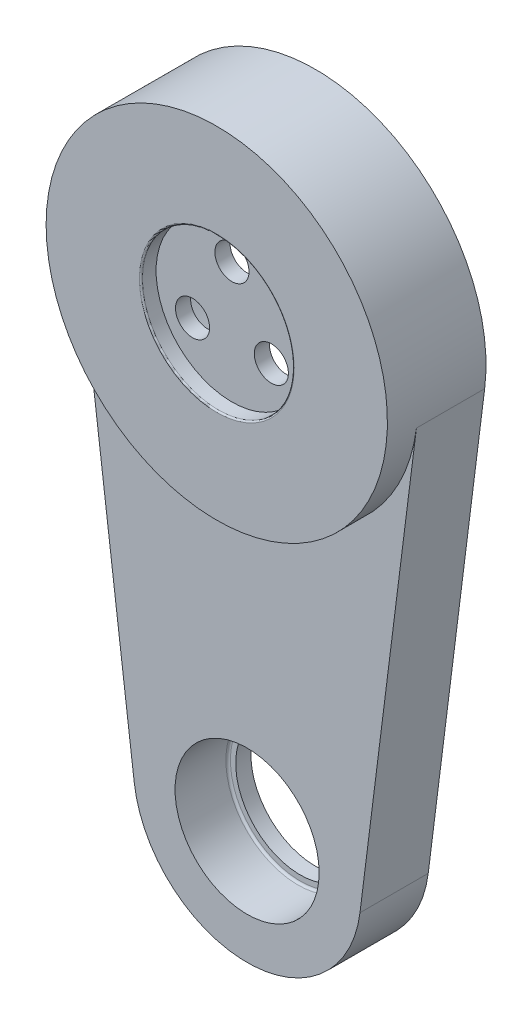
ISO-10303-21;
HEADER;
FILE_DESCRIPTION(('STEP AP214'),'2;1');
FILE_NAME('part.step','',(''),(''),'','','');
FILE_SCHEMA(('AUTOMOTIVE_DESIGN { 1 0 10303 214 1 1 1 1 }'));
ENDSEC;
DATA;
#1=APPLICATION_CONTEXT('core data for automotive mechanical design processes');
#2=APPLICATION_PROTOCOL_DEFINITION('international standard','automotive_design',2000,#1);
#3=PRODUCT_CONTEXT('',#1,'mechanical');
#4=PRODUCT('Part','Part','',(#3));
#5=PRODUCT_RELATED_PRODUCT_CATEGORY('part','',(#4));
#6=PRODUCT_DEFINITION_FORMATION('','',#4);
#7=PRODUCT_DEFINITION_CONTEXT('part definition',#1,'design');
#8=PRODUCT_DEFINITION('design','',#6,#7);
#9=PRODUCT_DEFINITION_SHAPE('','',#8);
#10=(LENGTH_UNIT() NAMED_UNIT(*) SI_UNIT(.MILLI.,.METRE.));
#11=(NAMED_UNIT(*) PLANE_ANGLE_UNIT() SI_UNIT($,.RADIAN.));
#12=(NAMED_UNIT(*) SI_UNIT($,.STERADIAN.) SOLID_ANGLE_UNIT());
#13=UNCERTAINTY_MEASURE_WITH_UNIT(LENGTH_MEASURE(1.E-05),#10,'distance_accuracy_value','');
#14=(GEOMETRIC_REPRESENTATION_CONTEXT(3) GLOBAL_UNCERTAINTY_ASSIGNED_CONTEXT((#13)) GLOBAL_UNIT_ASSIGNED_CONTEXT((#10,
#11,#12)) REPRESENTATION_CONTEXT('',''));
#15=CARTESIAN_POINT('',(0.,0.,0.));
#16=DIRECTION('',(0.,0.,1.));
#17=DIRECTION('',(1.,0.,0.));
#18=AXIS2_PLACEMENT_3D('',#15,#16,#17);
#19=CARTESIAN_POINT('',(0.,0.,-5.));
#20=DIRECTION('',(0.,0.,-1.));
#21=DIRECTION('',(-1.,0.,0.));
#22=AXIS2_PLACEMENT_3D('',#19,#20,#21);
#23=PLANE('',#22);
#24=CARTESIAN_POINT('',(0.,6.,-5.));
#25=DIRECTION('',(0.,0.,-1.));
#26=DIRECTION('',(-1.,0.,0.));
#27=AXIS2_PLACEMENT_3D('',#24,#25,#26);
#28=CIRCLE('',#27,3.99999999999999);
#29=CARTESIAN_POINT('',(-3.99999999999999,6.,-5.));
#30=VERTEX_POINT('',#29);
#31=EDGE_CURVE('E134',#30,#30,#28,.T.);
#32=ORIENTED_EDGE('',*,*,#31,.F.);
#33=EDGE_LOOP('',(#32));
#34=FACE_BOUND('',#33,.T.);
#35=CARTESIAN_POINT('',(-5.19615242270662,-3.00000000000003,-5.));
#36=DIRECTION('',(0.,0.,-1.));
#37=DIRECTION('',(-1.,0.,0.));
#38=AXIS2_PLACEMENT_3D('',#35,#36,#37);
#39=CIRCLE('',#38,3.99999999999999);
#40=CARTESIAN_POINT('',(-9.19615242270661,-3.00000000000003,-5.));
#41=VERTEX_POINT('',#40);
#42=EDGE_CURVE('E124',#41,#41,#39,.T.);
#43=ORIENTED_EDGE('',*,*,#42,.F.);
#44=EDGE_LOOP('',(#43));
#45=FACE_BOUND('',#44,.T.);
#46=CARTESIAN_POINT('',(5.19615242270666,-2.99999999999995,-5.));
#47=DIRECTION('',(0.,0.,-1.));
#48=DIRECTION('',(-1.,0.,0.));
#49=AXIS2_PLACEMENT_3D('',#46,#47,#48);
#50=CIRCLE('',#49,3.99999999999999);
#51=CARTESIAN_POINT('',(1.19615242270667,-2.99999999999995,-5.));
#52=VERTEX_POINT('',#51);
#53=EDGE_CURVE('E114',#52,#52,#50,.T.);
#54=ORIENTED_EDGE('',*,*,#53,.F.);
#55=EDGE_LOOP('',(#54));
#56=FACE_BOUND('',#55,.T.);
#57=CARTESIAN_POINT('',(0.,0.,-5.));
#58=DIRECTION('',(0.,0.,-1.));
#59=DIRECTION('',(-1.,0.,0.));
#60=AXIS2_PLACEMENT_3D('',#57,#58,#59);
#61=CIRCLE('',#60,17.5);
#62=CARTESIAN_POINT('',(-17.5,0.,-5.));
#63=VERTEX_POINT('',#62);
#64=EDGE_CURVE('E161',#63,#63,#61,.F.);
#65=ORIENTED_EDGE('',*,*,#64,.F.);
#66=EDGE_LOOP('',(#65));
#67=FACE_BOUND('',#66,.T.);
#68=ADVANCED_FACE('F35',(#34,#45,#56,#67),#23,.T.);
#69=CARTESIAN_POINT('',(0.,0.,-2.));
#70=DIRECTION('',(0.,0.,1.));
#71=DIRECTION('',(1.,0.,0.));
#72=AXIS2_PLACEMENT_3D('',#69,#70,#71);
#73=CYLINDRICAL_SURFACE('',#72,22.5);
#74=CARTESIAN_POINT('',(0.,0.,0.));
#75=DIRECTION('',(0.,0.,-1.));
#76=DIRECTION('',(-1.,0.,0.));
#77=AXIS2_PLACEMENT_3D('',#74,#75,#76);
#78=CIRCLE('',#77,22.5);
#79=CARTESIAN_POINT('',(-22.5,0.,0.));
#80=VERTEX_POINT('',#79);
#81=EDGE_CURVE('E152',#80,#80,#78,.T.);
#82=ORIENTED_EDGE('',*,*,#81,.T.);
#83=EDGE_LOOP('',(#82));
#84=FACE_BOUND('',#83,.T.);
#85=CARTESIAN_POINT('',(0.,0.,-13.));
#86=DIRECTION('',(0.,0.,-1.));
#87=DIRECTION('',(-1.,0.,0.));
#88=AXIS2_PLACEMENT_3D('',#85,#86,#87);
#89=CIRCLE('',#88,22.5);
#90=CARTESIAN_POINT('',(-22.3235266871075,-2.81250000000001,-13.));
#91=VERTEX_POINT('',#90);
#92=CARTESIAN_POINT('',(22.3235266871075,-2.81250000000001,-13.));
#93=VERTEX_POINT('',#92);
#94=EDGE_CURVE('E147',#91,#93,#89,.T.);
#95=ORIENTED_EDGE('',*,*,#94,.F.);
#96=DIRECTION('',(0.,0.,-1.));
#97=VECTOR('',#96,1.);
#98=CARTESIAN_POINT('',(-22.3235266871075,-2.81250000000001,-4.));
#99=LINE('',#98,#97);
#100=CARTESIAN_POINT('',(-22.3235266871075,-2.81250000000001,-4.));
#101=VERTEX_POINT('',#100);
#102=EDGE_CURVE('E107',#101,#91,#99,.T.);
#103=ORIENTED_EDGE('',*,*,#102,.F.);
#104=CARTESIAN_POINT('',(0.,0.,-4.));
#105=DIRECTION('',(0.,0.,1.));
#106=DIRECTION('',(-1.,0.,0.));
#107=AXIS2_PLACEMENT_3D('',#104,#105,#106);
#108=CIRCLE('',#107,22.5);
#109=CARTESIAN_POINT('',(22.3235266871075,-2.81250000000001,-4.));
#110=VERTEX_POINT('',#109);
#111=EDGE_CURVE('E59',#101,#110,#108,.T.);
#112=ORIENTED_EDGE('',*,*,#111,.T.);
#113=DIRECTION('',(0.,0.,-1.));
#114=VECTOR('',#113,1.);
#115=CARTESIAN_POINT('',(22.3235266871075,-2.81250000000001,-4.));
#116=LINE('',#115,#114);
#117=EDGE_CURVE('E83',#110,#93,#116,.T.);
#118=ORIENTED_EDGE('',*,*,#117,.T.);
#119=EDGE_LOOP('',(#95,#103,#112,#118));
#120=FACE_BOUND('',#119,.T.);
#121=ADVANCED_FACE('F191',(#84,#120),#73,.T.);
#122=CARTESIAN_POINT('',(0.,0.,0.));
#123=DIRECTION('',(0.,0.,-1.));
#124=DIRECTION('',(-1.,0.,0.));
#125=AXIS2_PLACEMENT_3D('',#122,#123,#124);
#126=PLANE('',#125);
#127=CARTESIAN_POINT('',(0.,0.,0.));
#128=DIRECTION('',(0.,0.,-1.));
#129=DIRECTION('',(-1.,0.,0.));
#130=AXIS2_PLACEMENT_3D('',#127,#128,#129);
#131=CIRCLE('',#130,10.2);
#132=CARTESIAN_POINT('',(-10.2,0.,0.));
#133=VERTEX_POINT('',#132);
#134=EDGE_CURVE('E158',#133,#133,#131,.T.);
#135=ORIENTED_EDGE('',*,*,#134,.T.);
#136=EDGE_LOOP('',(#135));
#137=FACE_BOUND('',#136,.T.);
#138=ORIENTED_EDGE('',*,*,#81,.F.);
#139=EDGE_LOOP('',(#138));
#140=FACE_BOUND('',#139,.T.);
#141=ADVANCED_FACE('F197',(#137,#140),#126,.F.);
#142=CARTESIAN_POINT('',(0.,0.,-2.));
#143=DIRECTION('',(0.,0.,1.));
#144=DIRECTION('',(1.,0.,0.));
#145=AXIS2_PLACEMENT_3D('',#142,#143,#144);
#146=CYLINDRICAL_SURFACE('',#145,10.);
#147=CARTESIAN_POINT('',(0.,0.,-0.2));
#148=DIRECTION('',(0.,0.,-1.));
#149=DIRECTION('',(-1.,0.,0.));
#150=AXIS2_PLACEMENT_3D('',#147,#148,#149);
#151=CIRCLE('',#150,10.);
#152=CARTESIAN_POINT('',(-10.,0.,-0.2));
#153=VERTEX_POINT('',#152);
#154=EDGE_CURVE('E155',#153,#153,#151,.F.);
#155=ORIENTED_EDGE('',*,*,#154,.T.);
#156=EDGE_LOOP('',(#155));
#157=FACE_BOUND('',#156,.T.);
#158=CARTESIAN_POINT('',(0.,0.,-2.));
#159=DIRECTION('',(0.,0.,1.));
#160=DIRECTION('',(1.,0.,0.));
#161=AXIS2_PLACEMENT_3D('',#158,#159,#160);
#162=CIRCLE('',#161,10.);
#163=CARTESIAN_POINT('',(10.,0.,-2.));
#164=VERTEX_POINT('',#163);
#165=EDGE_CURVE('E149',#164,#164,#162,.T.);
#166=ORIENTED_EDGE('',*,*,#165,.F.);
#167=EDGE_LOOP('',(#166));
#168=FACE_BOUND('',#167,.T.);
#169=ADVANCED_FACE('F219',(#157,#168),#146,.F.);
#170=CARTESIAN_POINT('',(0.,0.,-0.2));
#171=DIRECTION('',(0.,0.,-1.));
#172=DIRECTION('',(-1.,0.,0.));
#173=AXIS2_PLACEMENT_3D('',#170,#171,#172);
#174=TOROIDAL_SURFACE('',#173,10.2,0.2);
#175=ORIENTED_EDGE('',*,*,#134,.F.);
#176=EDGE_LOOP('',(#175));
#177=FACE_BOUND('',#176,.T.);
#178=ORIENTED_EDGE('',*,*,#154,.F.);
#179=EDGE_LOOP('',(#178));
#180=FACE_BOUND('',#179,.T.);
#181=ADVANCED_FACE('F217',(#177,#180),#174,.T.);
#182=CARTESIAN_POINT('',(0.,0.,-2.));
#183=DIRECTION('',(0.,0.,-1.));
#184=DIRECTION('',(-1.,0.,0.));
#185=AXIS2_PLACEMENT_3D('',#182,#183,#184);
#186=PLANE('',#185);
#187=CARTESIAN_POINT('',(5.19615242270666,-2.99999999999995,-2.));
#188=DIRECTION('',(0.,0.,-1.));
#189=DIRECTION('',(-1.,0.,0.));
#190=AXIS2_PLACEMENT_3D('',#187,#188,#189);
#191=CIRCLE('',#190,2.25);
#192=CARTESIAN_POINT('',(2.94615242270666,-2.99999999999995,-2.));
#193=VERTEX_POINT('',#192);
#194=EDGE_CURVE('E123',#193,#193,#191,.T.);
#195=ORIENTED_EDGE('',*,*,#194,.T.);
#196=EDGE_LOOP('',(#195));
#197=FACE_BOUND('',#196,.T.);
#198=CARTESIAN_POINT('',(-5.19615242270662,-3.00000000000003,-2.));
#199=DIRECTION('',(0.,0.,-1.));
#200=DIRECTION('',(-1.,0.,0.));
#201=AXIS2_PLACEMENT_3D('',#198,#199,#200);
#202=CIRCLE('',#201,2.25);
#203=CARTESIAN_POINT('',(-7.44615242270662,-3.00000000000003,-2.));
#204=VERTEX_POINT('',#203);
#205=EDGE_CURVE('E133',#204,#204,#202,.T.);
#206=ORIENTED_EDGE('',*,*,#205,.T.);
#207=EDGE_LOOP('',(#206));
#208=FACE_BOUND('',#207,.T.);
#209=CARTESIAN_POINT('',(0.,6.,-2.));
#210=DIRECTION('',(0.,0.,-1.));
#211=DIRECTION('',(-1.,0.,0.));
#212=AXIS2_PLACEMENT_3D('',#209,#210,#211);
#213=CIRCLE('',#212,2.25);
#214=CARTESIAN_POINT('',(-2.25,6.,-2.));
#215=VERTEX_POINT('',#214);
#216=EDGE_CURVE('E143',#215,#215,#213,.T.);
#217=ORIENTED_EDGE('',*,*,#216,.T.);
#218=EDGE_LOOP('',(#217));
#219=FACE_BOUND('',#218,.T.);
#220=ORIENTED_EDGE('',*,*,#165,.T.);
#221=EDGE_LOOP('',(#220));
#222=FACE_BOUND('',#221,.T.);
#223=ADVANCED_FACE('F213',(#197,#208,#219,#222),#186,.F.);
#224=CARTESIAN_POINT('',(0.,0.,-13.));
#225=DIRECTION('',(0.,0.,-1.));
#226=DIRECTION('',(-1.,0.,0.));
#227=AXIS2_PLACEMENT_3D('',#224,#225,#226);
#228=PLANE('',#227);
#229=CARTESIAN_POINT('',(0.,-60.,-13.));
#230=DIRECTION('',(0.,0.,1.));
#231=DIRECTION('',(1.,0.,0.));
#232=AXIS2_PLACEMENT_3D('',#229,#230,#231);
#233=CIRCLE('',#232,8.50000000000001);
#234=CARTESIAN_POINT('',(8.5,-60.,-13.));
#235=VERTEX_POINT('',#234);
#236=EDGE_CURVE('E516',#235,#235,#233,.T.);
#237=ORIENTED_EDGE('',*,*,#236,.T.);
#238=EDGE_LOOP('',(#237));
#239=FACE_BOUND('',#238,.T.);
#240=CARTESIAN_POINT('',(0.,0.,-13.));
#241=DIRECTION('',(0.,0.,-1.));
#242=DIRECTION('',(-1.,0.,0.));
#243=AXIS2_PLACEMENT_3D('',#240,#241,#242);
#244=CIRCLE('',#243,18.5);
#245=CARTESIAN_POINT('',(-18.5,0.,-13.));
#246=VERTEX_POINT('',#245);
#247=EDGE_CURVE('E144',#246,#246,#244,.T.);
#248=ORIENTED_EDGE('',*,*,#247,.F.);
#249=EDGE_LOOP('',(#248));
#250=FACE_BOUND('',#249,.T.);
#251=ORIENTED_EDGE('',*,*,#94,.T.);
#252=DIRECTION('',(-0.125,-0.992156741649222,0.));
#253=VECTOR('',#252,1.);
#254=CARTESIAN_POINT('',(22.3235266871075,-2.81250000000001,-13.));
#255=LINE('',#254,#253);
#256=CARTESIAN_POINT('',(14.8823511247383,-61.875,-13.));
#257=VERTEX_POINT('',#256);
#258=EDGE_CURVE('E102',#93,#257,#255,.T.);
#259=ORIENTED_EDGE('',*,*,#258,.T.);
#260=CARTESIAN_POINT('',(0.,-60.,-13.));
#261=DIRECTION('',(0.,0.,-1.));
#262=DIRECTION('',(-1.,0.,0.));
#263=AXIS2_PLACEMENT_3D('',#260,#261,#262);
#264=CIRCLE('',#263,15.);
#265=CARTESIAN_POINT('',(-14.8823511247383,-61.875,-13.));
#266=VERTEX_POINT('',#265);
#267=EDGE_CURVE('E89',#257,#266,#264,.T.);
#268=ORIENTED_EDGE('',*,*,#267,.T.);
#269=DIRECTION('',(-0.125,0.992156741649222,0.));
#270=VECTOR('',#269,1.);
#271=CARTESIAN_POINT('',(-22.3235266871075,-2.81250000000001,-13.));
#272=LINE('',#271,#270);
#273=EDGE_CURVE('E50',#266,#91,#272,.T.);
#274=ORIENTED_EDGE('',*,*,#273,.T.);
#275=EDGE_LOOP('',(#251,#259,#268,#274));
#276=FACE_BOUND('',#275,.T.);
#277=ADVANCED_FACE('F209',(#239,#250,#276),#228,.T.);
#278=CARTESIAN_POINT('',(0.,0.,-5.));
#279=DIRECTION('',(0.,0.,-1.));
#280=DIRECTION('',(-1.,0.,0.));
#281=AXIS2_PLACEMENT_3D('',#278,#279,#280);
#282=CYLINDRICAL_SURFACE('',#281,18.5);
#283=CARTESIAN_POINT('',(0.,0.,-6.3));
#284=DIRECTION('',(0.,0.,-1.));
#285=DIRECTION('',(-1.,0.,0.));
#286=AXIS2_PLACEMENT_3D('',#283,#284,#285);
#287=CIRCLE('',#286,18.5);
#288=CARTESIAN_POINT('',(-18.5,0.,-6.3));
#289=VERTEX_POINT('',#288);
#290=EDGE_CURVE('E173',#289,#289,#287,.F.);
#291=ORIENTED_EDGE('',*,*,#290,.T.);
#292=EDGE_LOOP('',(#291));
#293=FACE_BOUND('',#292,.T.);
#294=ORIENTED_EDGE('',*,*,#247,.T.);
#295=EDGE_LOOP('',(#294));
#296=FACE_BOUND('',#295,.T.);
#297=ADVANCED_FACE('F206',(#293,#296),#282,.F.);
#298=CARTESIAN_POINT('',(0.,6.,-5.));
#299=DIRECTION('',(0.,0.,-1.));
#300=DIRECTION('',(-1.,0.,0.));
#301=AXIS2_PLACEMENT_3D('',#298,#299,#300);
#302=CYLINDRICAL_SURFACE('',#301,2.25);
#303=CARTESIAN_POINT('',(0.,6.,-4.));
#304=DIRECTION('',(0.,0.,-1.));
#305=DIRECTION('',(-1.,0.,0.));
#306=AXIS2_PLACEMENT_3D('',#303,#304,#305);
#307=CIRCLE('',#306,2.25);
#308=CARTESIAN_POINT('',(-2.25,6.,-4.));
#309=VERTEX_POINT('',#308);
#310=EDGE_CURVE('E140',#309,#309,#307,.T.);
#311=ORIENTED_EDGE('',*,*,#310,.T.);
#312=EDGE_LOOP('',(#311));
#313=FACE_BOUND('',#312,.T.);
#314=ORIENTED_EDGE('',*,*,#216,.F.);
#315=EDGE_LOOP('',(#314));
#316=FACE_BOUND('',#315,.T.);
#317=ADVANCED_FACE('F204',(#313,#316),#302,.F.);
#318=CARTESIAN_POINT('',(2.25,6.,-4.));
#319=DIRECTION('',(0.,0.,1.));
#320=DIRECTION('',(1.,0.,0.));
#321=AXIS2_PLACEMENT_3D('',#318,#319,#320);
#322=PLANE('',#321);
#323=ORIENTED_EDGE('',*,*,#310,.F.);
#324=EDGE_LOOP('',(#323));
#325=FACE_BOUND('',#324,.T.);
#326=CARTESIAN_POINT('',(0.,6.,-4.));
#327=DIRECTION('',(0.,0.,-1.));
#328=DIRECTION('',(-1.,0.,0.));
#329=AXIS2_PLACEMENT_3D('',#326,#327,#328);
#330=CIRCLE('',#329,4.);
#331=CARTESIAN_POINT('',(-4.,6.,-4.));
#332=VERTEX_POINT('',#331);
#333=EDGE_CURVE('E137',#332,#332,#330,.T.);
#334=ORIENTED_EDGE('',*,*,#333,.T.);
#335=EDGE_LOOP('',(#334));
#336=FACE_BOUND('',#335,.T.);
#337=ADVANCED_FACE('F291',(#325,#336),#322,.F.);
#338=CARTESIAN_POINT('',(0.,6.,-5.));
#339=DIRECTION('',(0.,0.,-1.));
#340=DIRECTION('',(-1.,0.,0.));
#341=AXIS2_PLACEMENT_3D('',#338,#339,#340);
#342=CYLINDRICAL_SURFACE('',#341,4.);
#343=ORIENTED_EDGE('',*,*,#333,.F.);
#344=EDGE_LOOP('',(#343));
#345=FACE_BOUND('',#344,.T.);
#346=ORIENTED_EDGE('',*,*,#31,.T.);
#347=EDGE_LOOP('',(#346));
#348=FACE_BOUND('',#347,.T.);
#349=ADVANCED_FACE('F288',(#345,#348),#342,.F.);
#350=CARTESIAN_POINT('',(-5.19615242270662,-3.00000000000003,-5.));
#351=DIRECTION('',(0.,0.,-1.));
#352=DIRECTION('',(-1.,0.,0.));
#353=AXIS2_PLACEMENT_3D('',#350,#351,#352);
#354=CYLINDRICAL_SURFACE('',#353,2.25);
#355=CARTESIAN_POINT('',(-5.19615242270662,-3.00000000000003,-4.));
#356=DIRECTION('',(0.,0.,-1.));
#357=DIRECTION('',(-1.,0.,0.));
#358=AXIS2_PLACEMENT_3D('',#355,#356,#357);
#359=CIRCLE('',#358,2.25);
#360=CARTESIAN_POINT('',(-7.44615242270662,-3.00000000000003,-4.));
#361=VERTEX_POINT('',#360);
#362=EDGE_CURVE('E130',#361,#361,#359,.T.);
#363=ORIENTED_EDGE('',*,*,#362,.T.);
#364=EDGE_LOOP('',(#363));
#365=FACE_BOUND('',#364,.T.);
#366=ORIENTED_EDGE('',*,*,#205,.F.);
#367=EDGE_LOOP('',(#366));
#368=FACE_BOUND('',#367,.T.);
#369=ADVANCED_FACE('F284',(#365,#368),#354,.F.);
#370=CARTESIAN_POINT('',(-2.94615242270662,-3.00000000000003,-4.));
#371=DIRECTION('',(0.,0.,1.));
#372=DIRECTION('',(1.,0.,0.));
#373=AXIS2_PLACEMENT_3D('',#370,#371,#372);
#374=PLANE('',#373);
#375=ORIENTED_EDGE('',*,*,#362,.F.);
#376=EDGE_LOOP('',(#375));
#377=FACE_BOUND('',#376,.T.);
#378=CARTESIAN_POINT('',(-5.19615242270662,-3.00000000000003,-4.));
#379=DIRECTION('',(0.,0.,-1.));
#380=DIRECTION('',(-1.,0.,0.));
#381=AXIS2_PLACEMENT_3D('',#378,#379,#380);
#382=CIRCLE('',#381,4.);
#383=CARTESIAN_POINT('',(-9.19615242270662,-3.00000000000003,-4.));
#384=VERTEX_POINT('',#383);
#385=EDGE_CURVE('E127',#384,#384,#382,.T.);
#386=ORIENTED_EDGE('',*,*,#385,.T.);
#387=EDGE_LOOP('',(#386));
#388=FACE_BOUND('',#387,.T.);
#389=ADVANCED_FACE('F280',(#377,#388),#374,.F.);
#390=CARTESIAN_POINT('',(-5.19615242270662,-3.00000000000003,-5.));
#391=DIRECTION('',(0.,0.,-1.));
#392=DIRECTION('',(-1.,0.,0.));
#393=AXIS2_PLACEMENT_3D('',#390,#391,#392);
#394=CYLINDRICAL_SURFACE('',#393,4.);
#395=ORIENTED_EDGE('',*,*,#385,.F.);
#396=EDGE_LOOP('',(#395));
#397=FACE_BOUND('',#396,.T.);
#398=ORIENTED_EDGE('',*,*,#42,.T.);
#399=EDGE_LOOP('',(#398));
#400=FACE_BOUND('',#399,.T.);
#401=ADVANCED_FACE('F276',(#397,#400),#394,.F.);
#402=CARTESIAN_POINT('',(5.19615242270666,-2.99999999999995,-5.));
#403=DIRECTION('',(0.,0.,-1.));
#404=DIRECTION('',(-1.,0.,0.));
#405=AXIS2_PLACEMENT_3D('',#402,#403,#404);
#406=CYLINDRICAL_SURFACE('',#405,2.25);
#407=CARTESIAN_POINT('',(5.19615242270666,-2.99999999999995,-4.));
#408=DIRECTION('',(0.,0.,-1.));
#409=DIRECTION('',(-1.,0.,0.));
#410=AXIS2_PLACEMENT_3D('',#407,#408,#409);
#411=CIRCLE('',#410,2.25);
#412=CARTESIAN_POINT('',(2.94615242270666,-2.99999999999995,-4.));
#413=VERTEX_POINT('',#412);
#414=EDGE_CURVE('E120',#413,#413,#411,.T.);
#415=ORIENTED_EDGE('',*,*,#414,.T.);
#416=EDGE_LOOP('',(#415));
#417=FACE_BOUND('',#416,.T.);
#418=ORIENTED_EDGE('',*,*,#194,.F.);
#419=EDGE_LOOP('',(#418));
#420=FACE_BOUND('',#419,.T.);
#421=ADVANCED_FACE('F272',(#417,#420),#406,.F.);
#422=CARTESIAN_POINT('',(7.44615242270666,-2.99999999999995,-4.));
#423=DIRECTION('',(0.,0.,1.));
#424=DIRECTION('',(1.,0.,0.));
#425=AXIS2_PLACEMENT_3D('',#422,#423,#424);
#426=PLANE('',#425);
#427=ORIENTED_EDGE('',*,*,#414,.F.);
#428=EDGE_LOOP('',(#427));
#429=FACE_BOUND('',#428,.T.);
#430=CARTESIAN_POINT('',(5.19615242270666,-2.99999999999995,-4.));
#431=DIRECTION('',(0.,0.,-1.));
#432=DIRECTION('',(-1.,0.,0.));
#433=AXIS2_PLACEMENT_3D('',#430,#431,#432);
#434=CIRCLE('',#433,4.);
#435=CARTESIAN_POINT('',(1.19615242270666,-2.99999999999995,-4.));
#436=VERTEX_POINT('',#435);
#437=EDGE_CURVE('E117',#436,#436,#434,.T.);
#438=ORIENTED_EDGE('',*,*,#437,.T.);
#439=EDGE_LOOP('',(#438));
#440=FACE_BOUND('',#439,.T.);
#441=ADVANCED_FACE('F268',(#429,#440),#426,.F.);
#442=CARTESIAN_POINT('',(5.19615242270666,-2.99999999999995,-5.));
#443=DIRECTION('',(0.,0.,-1.));
#444=DIRECTION('',(-1.,0.,0.));
#445=AXIS2_PLACEMENT_3D('',#442,#443,#444);
#446=CYLINDRICAL_SURFACE('',#445,4.);
#447=ORIENTED_EDGE('',*,*,#437,.F.);
#448=EDGE_LOOP('',(#447));
#449=FACE_BOUND('',#448,.T.);
#450=ORIENTED_EDGE('',*,*,#53,.T.);
#451=EDGE_LOOP('',(#450));
#452=FACE_BOUND('',#451,.T.);
#453=ADVANCED_FACE('F248',(#449,#452),#446,.F.);
#454=CARTESIAN_POINT('',(0.,0.,-6.));
#455=DIRECTION('',(0.,0.,-1.));
#456=DIRECTION('',(-1.,0.,0.));
#457=AXIS2_PLACEMENT_3D('',#454,#455,#456);
#458=PLANE('',#457);
#459=CARTESIAN_POINT('',(0.,0.,-6.));
#460=DIRECTION('',(0.,0.,-1.));
#461=DIRECTION('',(-1.,0.,0.));
#462=AXIS2_PLACEMENT_3D('',#459,#460,#461);
#463=CIRCLE('',#462,18.2);
#464=CARTESIAN_POINT('',(-18.2,0.,-6.));
#465=VERTEX_POINT('',#464);
#466=EDGE_CURVE('E170',#465,#465,#463,.T.);
#467=ORIENTED_EDGE('',*,*,#466,.T.);
#468=EDGE_LOOP('',(#467));
#469=FACE_BOUND('',#468,.T.);
#470=CARTESIAN_POINT('',(0.,0.,-6.));
#471=DIRECTION('',(0.,0.,-1.));
#472=DIRECTION('',(-1.,0.,0.));
#473=AXIS2_PLACEMENT_3D('',#470,#471,#472);
#474=CIRCLE('',#473,17.5);
#475=CARTESIAN_POINT('',(-17.5,0.,-6.));
#476=VERTEX_POINT('',#475);
#477=EDGE_CURVE('E109',#476,#476,#474,.T.);
#478=ORIENTED_EDGE('',*,*,#477,.F.);
#479=EDGE_LOOP('',(#478));
#480=FACE_BOUND('',#479,.T.);
#481=ADVANCED_FACE('F244',(#469,#480),#458,.T.);
#482=CARTESIAN_POINT('',(0.,0.,-6.));
#483=DIRECTION('',(0.,0.,1.));
#484=DIRECTION('',(1.,0.,0.));
#485=AXIS2_PLACEMENT_3D('',#482,#483,#484);
#486=CYLINDRICAL_SURFACE('',#485,17.5);
#487=ORIENTED_EDGE('',*,*,#477,.T.);
#488=EDGE_LOOP('',(#487));
#489=FACE_BOUND('',#488,.T.);
#490=ORIENTED_EDGE('',*,*,#64,.T.);
#491=EDGE_LOOP('',(#490));
#492=FACE_BOUND('',#491,.T.);
#493=ADVANCED_FACE('F247',(#489,#492),#486,.F.);
#494=CARTESIAN_POINT('',(-22.3235266871075,-2.81250000000001,-4.));
#495=DIRECTION('',(-0.992156741649221,-0.125,0.));
#496=DIRECTION('',(0.125,-0.992156741649221,0.));
#497=AXIS2_PLACEMENT_3D('',#494,#495,#496);
#498=PLANE('',#497);
#499=ORIENTED_EDGE('',*,*,#273,.F.);
#500=DIRECTION('',(0.,0.,-1.));
#501=VECTOR('',#500,1.);
#502=CARTESIAN_POINT('',(-14.8823511247383,-61.875,-4.));
#503=LINE('',#502,#501);
#504=CARTESIAN_POINT('',(-14.8823511247383,-61.875,-4.));
#505=VERTEX_POINT('',#504);
#506=EDGE_CURVE('E77',#505,#266,#503,.T.);
#507=ORIENTED_EDGE('',*,*,#506,.F.);
#508=DIRECTION('',(-0.125,0.992156741649222,0.));
#509=VECTOR('',#508,1.);
#510=CARTESIAN_POINT('',(-22.3235266871075,-2.81250000000001,-4.));
#511=LINE('',#510,#509);
#512=EDGE_CURVE('E94',#505,#101,#511,.T.);
#513=ORIENTED_EDGE('',*,*,#512,.T.);
#514=ORIENTED_EDGE('',*,*,#102,.T.);
#515=EDGE_LOOP('',(#499,#507,#513,#514));
#516=FACE_BOUND('',#515,.T.);
#517=ADVANCED_FACE('F254',(#516),#498,.T.);
#518=CARTESIAN_POINT('',(0.,-60.,-4.));
#519=DIRECTION('',(0.,0.,-1.));
#520=DIRECTION('',(-1.,0.,0.));
#521=AXIS2_PLACEMENT_3D('',#518,#519,#520);
#522=CYLINDRICAL_SURFACE('',#521,15.);
#523=ORIENTED_EDGE('',*,*,#267,.F.);
#524=DIRECTION('',(0.,0.,-1.));
#525=VECTOR('',#524,1.);
#526=CARTESIAN_POINT('',(14.8823511247383,-61.875,-4.));
#527=LINE('',#526,#525);
#528=CARTESIAN_POINT('',(14.8823511247383,-61.875,-4.));
#529=VERTEX_POINT('',#528);
#530=EDGE_CURVE('E85',#529,#257,#527,.T.);
#531=ORIENTED_EDGE('',*,*,#530,.F.);
#532=CARTESIAN_POINT('',(0.,-60.,-4.));
#533=DIRECTION('',(0.,0.,-1.));
#534=DIRECTION('',(-1.,0.,0.));
#535=AXIS2_PLACEMENT_3D('',#532,#533,#534);
#536=CIRCLE('',#535,15.);
#537=EDGE_CURVE('E88',#529,#505,#536,.T.);
#538=ORIENTED_EDGE('',*,*,#537,.T.);
#539=ORIENTED_EDGE('',*,*,#506,.T.);
#540=EDGE_LOOP('',(#523,#531,#538,#539));
#541=FACE_BOUND('',#540,.T.);
#542=ADVANCED_FACE('F87',(#541),#522,.T.);
#543=CARTESIAN_POINT('',(22.3235266871075,-2.81250000000001,-4.));
#544=DIRECTION('',(0.992156741649221,-0.125,0.));
#545=DIRECTION('',(0.125,0.992156741649221,0.));
#546=AXIS2_PLACEMENT_3D('',#543,#544,#545);
#547=PLANE('',#546);
#548=ORIENTED_EDGE('',*,*,#258,.F.);
#549=ORIENTED_EDGE('',*,*,#117,.F.);
#550=DIRECTION('',(-0.125,-0.992156741649222,0.));
#551=VECTOR('',#550,1.);
#552=CARTESIAN_POINT('',(22.3235266871075,-2.81250000000001,-4.));
#553=LINE('',#552,#551);
#554=EDGE_CURVE('E93',#110,#529,#553,.T.);
#555=ORIENTED_EDGE('',*,*,#554,.T.);
#556=ORIENTED_EDGE('',*,*,#530,.T.);
#557=EDGE_LOOP('',(#548,#549,#555,#556));
#558=FACE_BOUND('',#557,.T.);
#559=ADVANCED_FACE('F96',(#558),#547,.T.);
#560=CARTESIAN_POINT('',(0.,0.,-4.));
#561=DIRECTION('',(0.,0.,-1.));
#562=DIRECTION('',(-1.,0.,0.));
#563=AXIS2_PLACEMENT_3D('',#560,#561,#562);
#564=PLANE('',#563);
#565=CARTESIAN_POINT('',(0.,-60.,-4.));
#566=DIRECTION('',(0.,0.,1.));
#567=DIRECTION('',(1.,0.,0.));
#568=AXIS2_PLACEMENT_3D('',#565,#566,#567);
#569=CIRCLE('',#568,9.5);
#570=CARTESIAN_POINT('',(9.49999999999999,-60.,-4.));
#571=VERTEX_POINT('',#570);
#572=EDGE_CURVE('E104',#571,#571,#569,.T.);
#573=ORIENTED_EDGE('',*,*,#572,.F.);
#574=EDGE_LOOP('',(#573));
#575=FACE_BOUND('',#574,.T.);
#576=ORIENTED_EDGE('',*,*,#111,.F.);
#577=ORIENTED_EDGE('',*,*,#512,.F.);
#578=ORIENTED_EDGE('',*,*,#537,.F.);
#579=ORIENTED_EDGE('',*,*,#554,.F.);
#580=EDGE_LOOP('',(#576,#577,#578,#579));
#581=FACE_BOUND('',#580,.T.);
#582=ADVANCED_FACE('F92',(#575,#581),#564,.F.);
#583=CARTESIAN_POINT('',(0.,0.,-6.3));
#584=DIRECTION('',(0.,0.,-1.));
#585=DIRECTION('',(-1.,0.,0.));
#586=AXIS2_PLACEMENT_3D('',#583,#584,#585);
#587=TOROIDAL_SURFACE('',#586,18.2,0.3);
#588=ORIENTED_EDGE('',*,*,#290,.F.);
#589=EDGE_LOOP('',(#588));
#590=FACE_BOUND('',#589,.T.);
#591=ORIENTED_EDGE('',*,*,#466,.F.);
#592=EDGE_LOOP('',(#591));
#593=FACE_BOUND('',#592,.T.);
#594=ADVANCED_FACE('F228',(#590,#593),#587,.F.);
#595=CARTESIAN_POINT('',(0.,-60.,-11.));
#596=DIRECTION('',(0.,0.,1.));
#597=DIRECTION('',(1.,0.,0.));
#598=AXIS2_PLACEMENT_3D('',#595,#596,#597);
#599=CYLINDRICAL_SURFACE('',#598,9.5);
#600=CARTESIAN_POINT('',(0.,-60.,-10.7));
#601=DIRECTION('',(0.,0.,1.));
#602=DIRECTION('',(1.,0.,0.));
#603=AXIS2_PLACEMENT_3D('',#600,#601,#602);
#604=CIRCLE('',#603,9.5);
#605=CARTESIAN_POINT('',(9.49999999999999,-60.,-10.7));
#606=VERTEX_POINT('',#605);
#607=EDGE_CURVE('E11',#606,#606,#604,.F.);
#608=ORIENTED_EDGE('',*,*,#607,.T.);
#609=EDGE_LOOP('',(#608));
#610=FACE_BOUND('',#609,.T.);
#611=ORIENTED_EDGE('',*,*,#572,.T.);
#612=EDGE_LOOP('',(#611));
#613=FACE_BOUND('',#612,.T.);
#614=ADVANCED_FACE('F230',(#610,#613),#599,.F.);
#615=CARTESIAN_POINT('',(0.,-60.,-11.));
#616=DIRECTION('',(0.,0.,1.));
#617=DIRECTION('',(1.,0.,0.));
#618=AXIS2_PLACEMENT_3D('',#615,#616,#617);
#619=PLANE('',#618);
#620=CARTESIAN_POINT('',(0.,-60.,-11.));
#621=DIRECTION('',(0.,0.,1.));
#622=DIRECTION('',(1.,0.,0.));
#623=AXIS2_PLACEMENT_3D('',#620,#621,#622);
#624=CIRCLE('',#623,9.2);
#625=CARTESIAN_POINT('',(9.19999999999999,-60.,-11.));
#626=VERTEX_POINT('',#625);
#627=EDGE_CURVE('E43',#626,#626,#624,.T.);
#628=ORIENTED_EDGE('',*,*,#627,.T.);
#629=EDGE_LOOP('',(#628));
#630=FACE_BOUND('',#629,.T.);
#631=CARTESIAN_POINT('',(0.,-60.,-11.));
#632=DIRECTION('',(0.,0.,1.));
#633=DIRECTION('',(1.,0.,0.));
#634=AXIS2_PLACEMENT_3D('',#631,#632,#633);
#635=CIRCLE('',#634,8.50000000000001);
#636=CARTESIAN_POINT('',(8.5,-60.,-11.));
#637=VERTEX_POINT('',#636);
#638=EDGE_CURVE('E518',#637,#637,#635,.T.);
#639=ORIENTED_EDGE('',*,*,#638,.F.);
#640=EDGE_LOOP('',(#639));
#641=FACE_BOUND('',#640,.T.);
#642=ADVANCED_FACE('F178',(#630,#641),#619,.T.);
#643=CARTESIAN_POINT('',(0.,-60.,-13.));
#644=DIRECTION('',(0.,0.,1.));
#645=DIRECTION('',(1.,0.,0.));
#646=AXIS2_PLACEMENT_3D('',#643,#644,#645);
#647=CYLINDRICAL_SURFACE('',#646,8.50000000000001);
#648=ORIENTED_EDGE('',*,*,#236,.F.);
#649=EDGE_LOOP('',(#648));
#650=FACE_BOUND('',#649,.T.);
#651=ORIENTED_EDGE('',*,*,#638,.T.);
#652=EDGE_LOOP('',(#651));
#653=FACE_BOUND('',#652,.T.);
#654=ADVANCED_FACE('F182',(#650,#653),#647,.F.);
#655=CARTESIAN_POINT('',(0.,-60.,-10.7));
#656=DIRECTION('',(0.,0.,1.));
#657=DIRECTION('',(1.,0.,0.));
#658=AXIS2_PLACEMENT_3D('',#655,#656,#657);
#659=TOROIDAL_SURFACE('',#658,9.2,0.3);
#660=ORIENTED_EDGE('',*,*,#607,.F.);
#661=EDGE_LOOP('',(#660));
#662=FACE_BOUND('',#661,.T.);
#663=ORIENTED_EDGE('',*,*,#627,.F.);
#664=EDGE_LOOP('',(#663));
#665=FACE_BOUND('',#664,.T.);
#666=ADVANCED_FACE('F37',(#662,#665),#659,.F.);
#667=CLOSED_SHELL('',(#68,#121,#141,#169,#181,#223,#277,#297,#317,#337,#349,#369,#389,#401,#421,
#441,#453,#481,#493,#517,#542,#559,#582,#594,#614,#642,#654,#666));
#668=MANIFOLD_SOLID_BREP('B2',#667);
#669=ADVANCED_BREP_SHAPE_REPRESENTATION('',(#18,#668),#14);
#670=SHAPE_DEFINITION_REPRESENTATION(#9,#669);
ENDSEC;
END-ISO-10303-21;
